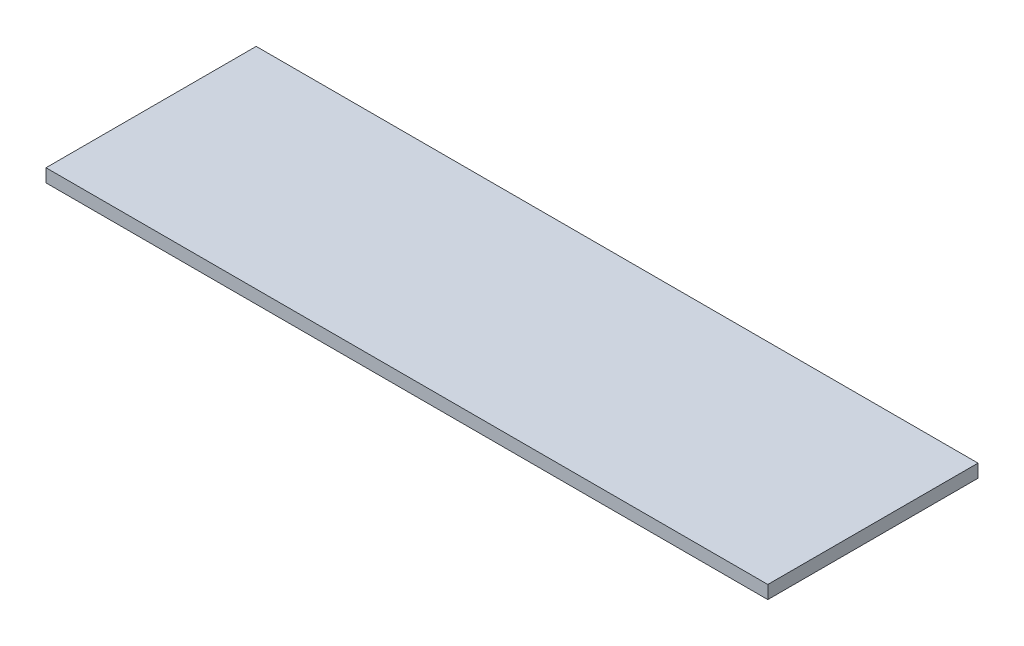
ISO-10303-21;
HEADER;
FILE_DESCRIPTION(('STEP AP214'),'2;1');
FILE_NAME('part.step','',(''),(''),'','','');
FILE_SCHEMA(('AUTOMOTIVE_DESIGN { 1 0 10303 214 1 1 1 1 }'));
ENDSEC;
DATA;
#1=APPLICATION_CONTEXT('core data for automotive mechanical design processes');
#2=APPLICATION_PROTOCOL_DEFINITION('international standard','automotive_design',2000,#1);
#3=PRODUCT_CONTEXT('',#1,'mechanical');
#4=PRODUCT('Part','Part','',(#3));
#5=PRODUCT_RELATED_PRODUCT_CATEGORY('part','',(#4));
#6=PRODUCT_DEFINITION_FORMATION('','',#4);
#7=PRODUCT_DEFINITION_CONTEXT('part definition',#1,'design');
#8=PRODUCT_DEFINITION('design','',#6,#7);
#9=PRODUCT_DEFINITION_SHAPE('','',#8);
#10=(LENGTH_UNIT() NAMED_UNIT(*) SI_UNIT(.MILLI.,.METRE.));
#11=(NAMED_UNIT(*) PLANE_ANGLE_UNIT() SI_UNIT($,.RADIAN.));
#12=(NAMED_UNIT(*) SI_UNIT($,.STERADIAN.) SOLID_ANGLE_UNIT());
#13=UNCERTAINTY_MEASURE_WITH_UNIT(LENGTH_MEASURE(1.E-05),#10,'distance_accuracy_value','');
#14=(GEOMETRIC_REPRESENTATION_CONTEXT(3) GLOBAL_UNCERTAINTY_ASSIGNED_CONTEXT((#13)) GLOBAL_UNIT_ASSIGNED_CONTEXT((#10,
#11,#12)) REPRESENTATION_CONTEXT('',''));
#15=CARTESIAN_POINT('',(0.,0.,0.));
#16=DIRECTION('',(0.,0.,1.));
#17=DIRECTION('',(1.,0.,0.));
#18=AXIS2_PLACEMENT_3D('',#15,#16,#17);
#19=CARTESIAN_POINT('',(-494.5,18.,144.));
#20=DIRECTION('',(1.,0.,0.));
#21=DIRECTION('',(0.,0.,-1.));
#22=AXIS2_PLACEMENT_3D('',#19,#20,#21);
#23=PLANE('',#22);
#24=DIRECTION('',(0.,0.,1.));
#25=VECTOR('',#24,1.);
#26=CARTESIAN_POINT('',(-494.5,0.,144.));
#27=LINE('',#26,#25);
#28=CARTESIAN_POINT('',(-494.5,0.,-144.));
#29=VERTEX_POINT('',#28);
#30=CARTESIAN_POINT('',(-494.5,0.,144.));
#31=VERTEX_POINT('',#30);
#32=EDGE_CURVE('E96',#29,#31,#27,.T.);
#33=ORIENTED_EDGE('',*,*,#32,.T.);
#34=DIRECTION('',(0.,-1.,0.));
#35=VECTOR('',#34,1.);
#36=CARTESIAN_POINT('',(-494.5,18.,144.));
#37=LINE('',#36,#35);
#38=CARTESIAN_POINT('',(-494.5,18.,144.));
#39=VERTEX_POINT('',#38);
#40=EDGE_CURVE('E11',#39,#31,#37,.T.);
#41=ORIENTED_EDGE('',*,*,#40,.F.);
#42=DIRECTION('',(0.,0.,1.));
#43=VECTOR('',#42,1.);
#44=CARTESIAN_POINT('',(-494.5,18.,144.));
#45=LINE('',#44,#43);
#46=CARTESIAN_POINT('',(-494.5,18.,-144.));
#47=VERTEX_POINT('',#46);
#48=EDGE_CURVE('E84',#47,#39,#45,.T.);
#49=ORIENTED_EDGE('',*,*,#48,.F.);
#50=DIRECTION('',(0.,-1.,0.));
#51=VECTOR('',#50,1.);
#52=CARTESIAN_POINT('',(-494.5,18.,-144.));
#53=LINE('',#52,#51);
#54=EDGE_CURVE('E92',#47,#29,#53,.T.);
#55=ORIENTED_EDGE('',*,*,#54,.T.);
#56=EDGE_LOOP('',(#33,#41,#49,#55));
#57=FACE_BOUND('',#56,.T.);
#58=ADVANCED_FACE('F33',(#57),#23,.F.);
#59=CARTESIAN_POINT('',(494.5,18.,144.));
#60=DIRECTION('',(0.,0.,-1.));
#61=DIRECTION('',(-1.,0.,0.));
#62=AXIS2_PLACEMENT_3D('',#59,#60,#61);
#63=PLANE('',#62);
#64=DIRECTION('',(1.,0.,0.));
#65=VECTOR('',#64,1.);
#66=CARTESIAN_POINT('',(494.5,0.,144.));
#67=LINE('',#66,#65);
#68=CARTESIAN_POINT('',(494.5,0.,144.));
#69=VERTEX_POINT('',#68);
#70=EDGE_CURVE('E88',#31,#69,#67,.T.);
#71=ORIENTED_EDGE('',*,*,#70,.T.);
#72=DIRECTION('',(0.,-1.,0.));
#73=VECTOR('',#72,1.);
#74=CARTESIAN_POINT('',(494.5,18.,144.));
#75=LINE('',#74,#73);
#76=CARTESIAN_POINT('',(494.5,18.,144.));
#77=VERTEX_POINT('',#76);
#78=EDGE_CURVE('E41',#77,#69,#75,.T.);
#79=ORIENTED_EDGE('',*,*,#78,.F.);
#80=DIRECTION('',(1.,0.,0.));
#81=VECTOR('',#80,1.);
#82=CARTESIAN_POINT('',(494.5,18.,144.));
#83=LINE('',#82,#81);
#84=EDGE_CURVE('E79',#39,#77,#83,.T.);
#85=ORIENTED_EDGE('',*,*,#84,.F.);
#86=ORIENTED_EDGE('',*,*,#40,.T.);
#87=EDGE_LOOP('',(#71,#79,#85,#86));
#88=FACE_BOUND('',#87,.T.);
#89=ADVANCED_FACE('F87',(#88),#63,.F.);
#90=CARTESIAN_POINT('',(494.5,18.,144.));
#91=DIRECTION('',(-1.,0.,0.));
#92=DIRECTION('',(0.,0.,1.));
#93=AXIS2_PLACEMENT_3D('',#90,#91,#92);
#94=PLANE('',#93);
#95=DIRECTION('',(0.,0.,-1.));
#96=VECTOR('',#95,1.);
#97=CARTESIAN_POINT('',(494.5,0.,144.));
#98=LINE('',#97,#96);
#99=CARTESIAN_POINT('',(494.5,0.,-144.));
#100=VERTEX_POINT('',#99);
#101=EDGE_CURVE('E66',#69,#100,#98,.T.);
#102=ORIENTED_EDGE('',*,*,#101,.T.);
#103=DIRECTION('',(0.,-1.,0.));
#104=VECTOR('',#103,1.);
#105=CARTESIAN_POINT('',(494.5,18.,-144.));
#106=LINE('',#105,#104);
#107=CARTESIAN_POINT('',(494.5,18.,-144.));
#108=VERTEX_POINT('',#107);
#109=EDGE_CURVE('E89',#108,#100,#106,.T.);
#110=ORIENTED_EDGE('',*,*,#109,.F.);
#111=DIRECTION('',(0.,0.,-1.));
#112=VECTOR('',#111,1.);
#113=CARTESIAN_POINT('',(494.5,18.,144.));
#114=LINE('',#113,#112);
#115=EDGE_CURVE('E82',#77,#108,#114,.T.);
#116=ORIENTED_EDGE('',*,*,#115,.F.);
#117=ORIENTED_EDGE('',*,*,#78,.T.);
#118=EDGE_LOOP('',(#102,#110,#116,#117));
#119=FACE_BOUND('',#118,.T.);
#120=ADVANCED_FACE('F90',(#119),#94,.F.);
#121=CARTESIAN_POINT('',(494.5,18.,-144.));
#122=DIRECTION('',(0.,0.,1.));
#123=DIRECTION('',(1.,0.,0.));
#124=AXIS2_PLACEMENT_3D('',#121,#122,#123);
#125=PLANE('',#124);
#126=DIRECTION('',(-1.,0.,0.));
#127=VECTOR('',#126,1.);
#128=CARTESIAN_POINT('',(494.5,0.,-144.));
#129=LINE('',#128,#127);
#130=EDGE_CURVE('E72',#100,#29,#129,.T.);
#131=ORIENTED_EDGE('',*,*,#130,.T.);
#132=ORIENTED_EDGE('',*,*,#54,.F.);
#133=DIRECTION('',(-1.,0.,0.));
#134=VECTOR('',#133,1.);
#135=CARTESIAN_POINT('',(494.5,18.,-144.));
#136=LINE('',#135,#134);
#137=EDGE_CURVE('E49',#108,#47,#136,.T.);
#138=ORIENTED_EDGE('',*,*,#137,.F.);
#139=ORIENTED_EDGE('',*,*,#109,.T.);
#140=EDGE_LOOP('',(#131,#132,#138,#139));
#141=FACE_BOUND('',#140,.T.);
#142=ADVANCED_FACE('F103',(#141),#125,.F.);
#143=CARTESIAN_POINT('',(0.,18.,0.));
#144=DIRECTION('',(0.,1.,0.));
#145=DIRECTION('',(0.,0.,1.));
#146=AXIS2_PLACEMENT_3D('',#143,#144,#145);
#147=PLANE('',#146);
#148=ORIENTED_EDGE('',*,*,#48,.T.);
#149=ORIENTED_EDGE('',*,*,#84,.T.);
#150=ORIENTED_EDGE('',*,*,#115,.T.);
#151=ORIENTED_EDGE('',*,*,#137,.T.);
#152=EDGE_LOOP('',(#148,#149,#150,#151));
#153=FACE_BOUND('',#152,.T.);
#154=ADVANCED_FACE('F80',(#153),#147,.T.);
#155=CARTESIAN_POINT('',(0.,0.,0.));
#156=DIRECTION('',(0.,1.,0.));
#157=DIRECTION('',(0.,0.,1.));
#158=AXIS2_PLACEMENT_3D('',#155,#156,#157);
#159=PLANE('',#158);
#160=ORIENTED_EDGE('',*,*,#32,.F.);
#161=ORIENTED_EDGE('',*,*,#130,.F.);
#162=ORIENTED_EDGE('',*,*,#101,.F.);
#163=ORIENTED_EDGE('',*,*,#70,.F.);
#164=EDGE_LOOP('',(#160,#161,#162,#163));
#165=FACE_BOUND('',#164,.T.);
#166=ADVANCED_FACE('F106',(#165),#159,.F.);
#167=CLOSED_SHELL('',(#58,#89,#120,#142,#154,#166));
#168=MANIFOLD_SOLID_BREP('B2',#167);
#169=ADVANCED_BREP_SHAPE_REPRESENTATION('',(#18,#168),#14);
#170=SHAPE_DEFINITION_REPRESENTATION(#9,#169);
ENDSEC;
END-ISO-10303-21;
